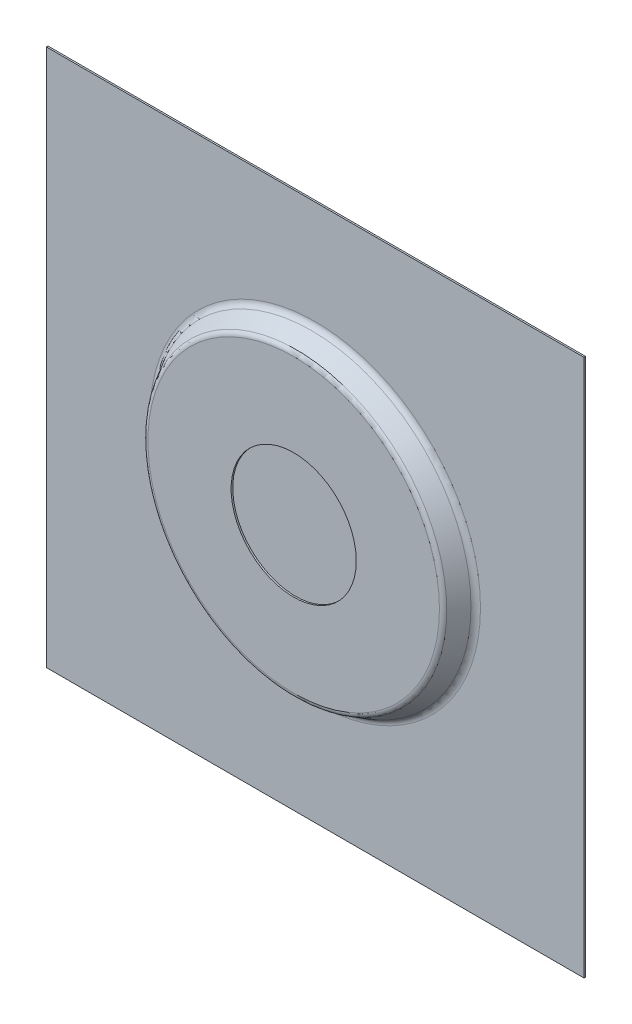
ISO-10303-21;
HEADER;
FILE_DESCRIPTION(('STEP AP214'),'2;1');
FILE_NAME('part.step','',(''),(''),'','','');
FILE_SCHEMA(('AUTOMOTIVE_DESIGN { 1 0 10303 214 1 1 1 1 }'));
ENDSEC;
DATA;
#1=APPLICATION_CONTEXT('core data for automotive mechanical design processes');
#2=APPLICATION_PROTOCOL_DEFINITION('international standard','automotive_design',2000,#1);
#3=PRODUCT_CONTEXT('',#1,'mechanical');
#4=PRODUCT('Part','Part','',(#3));
#5=PRODUCT_RELATED_PRODUCT_CATEGORY('part','',(#4));
#6=PRODUCT_DEFINITION_FORMATION('','',#4);
#7=PRODUCT_DEFINITION_CONTEXT('part definition',#1,'design');
#8=PRODUCT_DEFINITION('design','',#6,#7);
#9=PRODUCT_DEFINITION_SHAPE('','',#8);
#10=(LENGTH_UNIT() NAMED_UNIT(*) SI_UNIT(.MILLI.,.METRE.));
#11=(NAMED_UNIT(*) PLANE_ANGLE_UNIT() SI_UNIT($,.RADIAN.));
#12=(NAMED_UNIT(*) SI_UNIT($,.STERADIAN.) SOLID_ANGLE_UNIT());
#13=UNCERTAINTY_MEASURE_WITH_UNIT(LENGTH_MEASURE(1.E-05),#10,'distance_accuracy_value','');
#14=(GEOMETRIC_REPRESENTATION_CONTEXT(3) GLOBAL_UNCERTAINTY_ASSIGNED_CONTEXT((#13)) GLOBAL_UNIT_ASSIGNED_CONTEXT((#10,
#11,#12)) REPRESENTATION_CONTEXT('',''));
#15=CARTESIAN_POINT('',(0.,0.,0.));
#16=DIRECTION('',(0.,0.,1.));
#17=DIRECTION('',(1.,0.,0.));
#18=AXIS2_PLACEMENT_3D('',#15,#16,#17);
#19=CARTESIAN_POINT('',(0.,0.,6.5));
#20=DIRECTION('',(0.,0.,-1.));
#21=DIRECTION('',(-1.,0.,0.));
#22=AXIS2_PLACEMENT_3D('',#19,#20,#21);
#23=TOROIDAL_SURFACE('',#22,153.752776749733,8.);
#24=CARTESIAN_POINT('',(0.,0.,-1.5));
#25=DIRECTION('',(0.,0.,-1.));
#26=DIRECTION('',(-1.,0.,0.));
#27=AXIS2_PLACEMENT_3D('',#24,#25,#26);
#28=CIRCLE('',#27,153.752776749733);
#29=CARTESIAN_POINT('',(-153.752776749733,0.,-1.5));
#30=VERTEX_POINT('',#29);
#31=EDGE_CURVE('E11',#30,#30,#28,.T.);
#32=ORIENTED_EDGE('',*,*,#31,.F.);
#33=EDGE_LOOP('',(#32));
#34=FACE_BOUND('',#33,.T.);
#35=CARTESIAN_POINT('',(0.,0.,2.5));
#36=DIRECTION('',(0.,0.,-1.));
#37=DIRECTION('',(-1.,0.,0.));
#38=AXIS2_PLACEMENT_3D('',#35,#36,#37);
#39=CIRCLE('',#38,146.824573519457);
#40=CARTESIAN_POINT('',(-146.824573519457,0.,2.5));
#41=VERTEX_POINT('',#40);
#42=EDGE_CURVE('E58',#41,#41,#39,.F.);
#43=ORIENTED_EDGE('',*,*,#42,.F.);
#44=EDGE_LOOP('',(#43));
#45=FACE_BOUND('',#44,.T.);
#46=ADVANCED_FACE('F52',(#34,#45),#23,.F.);
#47=CARTESIAN_POINT('',(0.,0.,-0.750000000000002));
#48=DIRECTION('',(0.,0.,-1.));
#49=DIRECTION('',(1.,0.,0.));
#50=AXIS2_PLACEMENT_3D('',#47,#48,#49);
#51=CONICAL_SURFACE('',#50,148.700961894323,0.5235987755983);
#52=ORIENTED_EDGE('',*,*,#42,.T.);
#53=EDGE_LOOP('',(#52));
#54=FACE_BOUND('',#53,.T.);
#55=CARTESIAN_POINT('',(0.,0.,16.75));
#56=DIRECTION('',(0.,0.,-1.));
#57=DIRECTION('',(-1.,0.,0.));
#58=AXIS2_PLACEMENT_3D('',#55,#56,#57);
#59=CIRCLE('',#58,138.597332183505);
#60=CARTESIAN_POINT('',(-138.597332183505,0.,16.75));
#61=VERTEX_POINT('',#60);
#62=EDGE_CURVE('E63',#61,#61,#59,.T.);
#63=ORIENTED_EDGE('',*,*,#62,.T.);
#64=EDGE_LOOP('',(#63));
#65=FACE_BOUND('',#64,.T.);
#66=ADVANCED_FACE('F76',(#54,#65),#51,.T.);
#67=CARTESIAN_POINT('',(0.,0.,15.));
#68=DIRECTION('',(0.,0.,1.));
#69=DIRECTION('',(1.,0.,0.));
#70=AXIS2_PLACEMENT_3D('',#67,#68,#69);
#71=TOROIDAL_SURFACE('',#70,135.566243270259,3.5);
#72=ORIENTED_EDGE('',*,*,#62,.F.);
#73=EDGE_LOOP('',(#72));
#74=FACE_BOUND('',#73,.T.);
#75=CARTESIAN_POINT('',(0.,0.,18.5));
#76=DIRECTION('',(0.,0.,1.));
#77=DIRECTION('',(1.,0.,0.));
#78=AXIS2_PLACEMENT_3D('',#75,#76,#77);
#79=CIRCLE('',#78,135.566243270259);
#80=CARTESIAN_POINT('',(135.566243270259,0.,18.5));
#81=VERTEX_POINT('',#80);
#82=EDGE_CURVE('E68',#81,#81,#79,.T.);
#83=ORIENTED_EDGE('',*,*,#82,.F.);
#84=EDGE_LOOP('',(#83));
#85=FACE_BOUND('',#84,.T.);
#86=ADVANCED_FACE('F74',(#74,#85),#71,.T.);
#87=CARTESIAN_POINT('',(0.,0.,18.5));
#88=DIRECTION('',(0.,0.,1.));
#89=DIRECTION('',(1.,0.,0.));
#90=AXIS2_PLACEMENT_3D('',#87,#88,#89);
#91=PLANE('',#90);
#92=ORIENTED_EDGE('',*,*,#82,.T.);
#93=EDGE_LOOP('',(#92));
#94=FACE_BOUND('',#93,.T.);
#95=ADVANCED_FACE('F53',(#94),#91,.T.);
#96=OPEN_SHELL('',(#46,#66,#86,#95));
#97=SHELL_BASED_SURFACE_MODEL('B2',(#96));
#98=CARTESIAN_POINT('',(250.,-250.,-1.5));
#99=DIRECTION('',(1.,0.,0.));
#100=DIRECTION('',(0.,0.,-1.));
#101=AXIS2_PLACEMENT_3D('',#98,#99,#100);
#102=PLANE('',#101);
#103=DIRECTION('',(0.,1.,0.));
#104=VECTOR('',#103,1.);
#105=CARTESIAN_POINT('',(250.,-250.,0.));
#106=LINE('',#105,#104);
#107=CARTESIAN_POINT('',(250.,-250.,0.));
#108=VERTEX_POINT('',#107);
#109=CARTESIAN_POINT('',(250.,250.,0.));
#110=VERTEX_POINT('',#109);
#111=EDGE_CURVE('E191',#108,#110,#106,.T.);
#112=ORIENTED_EDGE('',*,*,#111,.F.);
#113=DIRECTION('',(0.,0.,1.));
#114=VECTOR('',#113,1.);
#115=CARTESIAN_POINT('',(250.,-250.,-1.5));
#116=LINE('',#115,#114);
#117=CARTESIAN_POINT('',(250.,-250.,-1.5));
#118=VERTEX_POINT('',#117);
#119=EDGE_CURVE('E134',#118,#108,#116,.T.);
#120=ORIENTED_EDGE('',*,*,#119,.F.);
#121=DIRECTION('',(0.,1.,0.));
#122=VECTOR('',#121,1.);
#123=CARTESIAN_POINT('',(250.,-250.,-1.5));
#124=LINE('',#123,#122);
#125=CARTESIAN_POINT('',(250.,250.,-1.5));
#126=VERTEX_POINT('',#125);
#127=EDGE_CURVE('E182',#118,#126,#124,.T.);
#128=ORIENTED_EDGE('',*,*,#127,.T.);
#129=DIRECTION('',(0.,0.,1.));
#130=VECTOR('',#129,1.);
#131=CARTESIAN_POINT('',(250.,250.,-1.5));
#132=LINE('',#131,#130);
#133=EDGE_CURVE('E162',#126,#110,#132,.T.);
#134=ORIENTED_EDGE('',*,*,#133,.T.);
#135=EDGE_LOOP('',(#112,#120,#128,#134));
#136=FACE_BOUND('',#135,.T.);
#137=ADVANCED_FACE('F115',(#136),#102,.T.);
#138=CARTESIAN_POINT('',(-250.,-250.,-1.5));
#139=DIRECTION('',(0.,-1.,0.));
#140=DIRECTION('',(0.,0.,-1.));
#141=AXIS2_PLACEMENT_3D('',#138,#139,#140);
#142=PLANE('',#141);
#143=DIRECTION('',(1.,0.,0.));
#144=VECTOR('',#143,1.);
#145=CARTESIAN_POINT('',(-250.,-250.,0.));
#146=LINE('',#145,#144);
#147=CARTESIAN_POINT('',(-250.,-250.,0.));
#148=VERTEX_POINT('',#147);
#149=EDGE_CURVE('E185',#148,#108,#146,.T.);
#150=ORIENTED_EDGE('',*,*,#149,.F.);
#151=DIRECTION('',(0.,0.,1.));
#152=VECTOR('',#151,1.);
#153=CARTESIAN_POINT('',(-250.,-250.,-1.5));
#154=LINE('',#153,#152);
#155=CARTESIAN_POINT('',(-250.,-250.,-1.5));
#156=VERTEX_POINT('',#155);
#157=EDGE_CURVE('E151',#156,#148,#154,.T.);
#158=ORIENTED_EDGE('',*,*,#157,.F.);
#159=DIRECTION('',(1.,0.,0.));
#160=VECTOR('',#159,1.);
#161=CARTESIAN_POINT('',(-250.,-250.,-1.5));
#162=LINE('',#161,#160);
#163=EDGE_CURVE('E177',#156,#118,#162,.T.);
#164=ORIENTED_EDGE('',*,*,#163,.T.);
#165=ORIENTED_EDGE('',*,*,#119,.T.);
#166=EDGE_LOOP('',(#150,#158,#164,#165));
#167=FACE_BOUND('',#166,.T.);
#168=ADVANCED_FACE('F242',(#167),#142,.T.);
#169=CARTESIAN_POINT('',(-250.,-250.,-1.5));
#170=DIRECTION('',(-1.,0.,0.));
#171=DIRECTION('',(0.,0.,1.));
#172=AXIS2_PLACEMENT_3D('',#169,#170,#171);
#173=PLANE('',#172);
#174=DIRECTION('',(0.,-1.,0.));
#175=VECTOR('',#174,1.);
#176=CARTESIAN_POINT('',(-250.,-250.,0.));
#177=LINE('',#176,#175);
#178=CARTESIAN_POINT('',(-250.,250.,0.));
#179=VERTEX_POINT('',#178);
#180=EDGE_CURVE('E170',#179,#148,#177,.T.);
#181=ORIENTED_EDGE('',*,*,#180,.F.);
#182=DIRECTION('',(0.,0.,1.));
#183=VECTOR('',#182,1.);
#184=CARTESIAN_POINT('',(-250.,250.,-1.5));
#185=LINE('',#184,#183);
#186=CARTESIAN_POINT('',(-250.,250.,-1.5));
#187=VERTEX_POINT('',#186);
#188=EDGE_CURVE('E165',#187,#179,#185,.T.);
#189=ORIENTED_EDGE('',*,*,#188,.F.);
#190=DIRECTION('',(0.,-1.,0.));
#191=VECTOR('',#190,1.);
#192=CARTESIAN_POINT('',(-250.,-250.,-1.5));
#193=LINE('',#192,#191);
#194=EDGE_CURVE('E168',#187,#156,#193,.T.);
#195=ORIENTED_EDGE('',*,*,#194,.T.);
#196=ORIENTED_EDGE('',*,*,#157,.T.);
#197=EDGE_LOOP('',(#181,#189,#195,#196));
#198=FACE_BOUND('',#197,.T.);
#199=ADVANCED_FACE('F167',(#198),#173,.T.);
#200=CARTESIAN_POINT('',(-250.,250.,-1.5));
#201=DIRECTION('',(0.,1.,0.));
#202=DIRECTION('',(0.,0.,1.));
#203=AXIS2_PLACEMENT_3D('',#200,#201,#202);
#204=PLANE('',#203);
#205=DIRECTION('',(-1.,0.,0.));
#206=VECTOR('',#205,1.);
#207=CARTESIAN_POINT('',(-250.,250.,0.));
#208=LINE('',#207,#206);
#209=EDGE_CURVE('E195',#110,#179,#208,.T.);
#210=ORIENTED_EDGE('',*,*,#209,.F.);
#211=ORIENTED_EDGE('',*,*,#133,.F.);
#212=DIRECTION('',(-1.,0.,0.));
#213=VECTOR('',#212,1.);
#214=CARTESIAN_POINT('',(-250.,250.,-1.5));
#215=LINE('',#214,#213);
#216=EDGE_CURVE('E176',#126,#187,#215,.T.);
#217=ORIENTED_EDGE('',*,*,#216,.T.);
#218=ORIENTED_EDGE('',*,*,#188,.T.);
#219=EDGE_LOOP('',(#210,#211,#217,#218));
#220=FACE_BOUND('',#219,.T.);
#221=ADVANCED_FACE('F180',(#220),#204,.T.);
#222=CARTESIAN_POINT('',(0.,0.,-1.5));
#223=DIRECTION('',(0.,0.,-1.));
#224=DIRECTION('',(-1.,0.,0.));
#225=AXIS2_PLACEMENT_3D('',#222,#223,#224);
#226=PLANE('',#225);
#227=CARTESIAN_POINT('',(0.,0.,-1.5));
#228=DIRECTION('',(0.,0.,-1.));
#229=DIRECTION('',(-1.,0.,0.));
#230=AXIS2_PLACEMENT_3D('',#227,#228,#229);
#231=CIRCLE('',#230,153.752776749733);
#232=CARTESIAN_POINT('',(-153.752776749733,0.,-1.5));
#233=VERTEX_POINT('',#232);
#234=EDGE_CURVE('E50',#233,#233,#231,.T.);
#235=ORIENTED_EDGE('',*,*,#234,.F.);
#236=EDGE_LOOP('',(#235));
#237=FACE_BOUND('',#236,.T.);
#238=ORIENTED_EDGE('',*,*,#127,.F.);
#239=ORIENTED_EDGE('',*,*,#163,.F.);
#240=ORIENTED_EDGE('',*,*,#194,.F.);
#241=ORIENTED_EDGE('',*,*,#216,.F.);
#242=EDGE_LOOP('',(#238,#239,#240,#241));
#243=FACE_BOUND('',#242,.T.);
#244=ADVANCED_FACE('F175',(#237,#243),#226,.T.);
#245=CARTESIAN_POINT('',(0.,0.,0.));
#246=DIRECTION('',(0.,0.,-1.));
#247=DIRECTION('',(-1.,0.,0.));
#248=AXIS2_PLACEMENT_3D('',#245,#246,#247);
#249=PLANE('',#248);
#250=CARTESIAN_POINT('',(0.,0.,0.));
#251=DIRECTION('',(0.,0.,-1.));
#252=DIRECTION('',(-1.,0.,0.));
#253=AXIS2_PLACEMENT_3D('',#250,#251,#252);
#254=CIRCLE('',#253,153.752776749733);
#255=CARTESIAN_POINT('',(-153.752776749733,0.,0.));
#256=VERTEX_POINT('',#255);
#257=EDGE_CURVE('E218',#256,#256,#254,.T.);
#258=ORIENTED_EDGE('',*,*,#257,.T.);
#259=EDGE_LOOP('',(#258));
#260=FACE_BOUND('',#259,.T.);
#261=ORIENTED_EDGE('',*,*,#111,.T.);
#262=ORIENTED_EDGE('',*,*,#209,.T.);
#263=ORIENTED_EDGE('',*,*,#180,.T.);
#264=ORIENTED_EDGE('',*,*,#149,.T.);
#265=EDGE_LOOP('',(#261,#262,#263,#264));
#266=FACE_BOUND('',#265,.T.);
#267=ADVANCED_FACE('F253',(#260,#266),#249,.F.);
#268=CARTESIAN_POINT('',(0.,0.,0.));
#269=DIRECTION('',(0.,0.,-1.));
#270=DIRECTION('',(1.,0.,0.));
#271=AXIS2_PLACEMENT_3D('',#268,#269,#270);
#272=CONICAL_SURFACE('',#271,150.,0.5235987755983);
#273=CARTESIAN_POINT('',(0.,0.,3.25));
#274=DIRECTION('',(0.,0.,-1.));
#275=DIRECTION('',(-1.,0.,0.));
#276=AXIS2_PLACEMENT_3D('',#273,#274,#275);
#277=CIRCLE('',#276,148.123611625134);
#278=CARTESIAN_POINT('',(-148.123611625134,0.,3.25));
#279=VERTEX_POINT('',#278);
#280=EDGE_CURVE('E214',#279,#279,#277,.F.);
#281=ORIENTED_EDGE('',*,*,#280,.T.);
#282=EDGE_LOOP('',(#281));
#283=FACE_BOUND('',#282,.T.);
#284=CARTESIAN_POINT('',(0.,0.,17.5));
#285=DIRECTION('',(0.,0.,-1.));
#286=DIRECTION('',(-1.,0.,0.));
#287=AXIS2_PLACEMENT_3D('',#284,#285,#286);
#288=CIRCLE('',#287,139.896370289182);
#289=CARTESIAN_POINT('',(-139.896370289182,0.,17.5));
#290=VERTEX_POINT('',#289);
#291=EDGE_CURVE('E206',#290,#290,#288,.T.);
#292=ORIENTED_EDGE('',*,*,#291,.T.);
#293=EDGE_LOOP('',(#292));
#294=FACE_BOUND('',#293,.T.);
#295=ADVANCED_FACE('F256',(#283,#294),#272,.T.);
#296=CARTESIAN_POINT('',(0.,0.,20.));
#297=DIRECTION('',(0.,0.,1.));
#298=DIRECTION('',(1.,0.,0.));
#299=AXIS2_PLACEMENT_3D('',#296,#297,#298);
#300=PLANE('',#299);
#301=CARTESIAN_POINT('',(0.,0.,20.));
#302=DIRECTION('',(0.,0.,1.));
#303=DIRECTION('',(1.,0.,0.));
#304=AXIS2_PLACEMENT_3D('',#301,#302,#303);
#305=CIRCLE('',#304,58.1962250746136);
#306=CARTESIAN_POINT('',(58.1962250746136,0.,20.));
#307=VERTEX_POINT('',#306);
#308=EDGE_CURVE('E286',#307,#307,#305,.T.);
#309=ORIENTED_EDGE('',*,*,#308,.F.);
#310=EDGE_LOOP('',(#309));
#311=FACE_BOUND('',#310,.T.);
#312=CARTESIAN_POINT('',(0.,0.,20.));
#313=DIRECTION('',(0.,0.,1.));
#314=DIRECTION('',(1.,0.,0.));
#315=AXIS2_PLACEMENT_3D('',#312,#313,#314);
#316=CIRCLE('',#315,135.566243270259);
#317=CARTESIAN_POINT('',(135.566243270259,0.,20.));
#318=VERTEX_POINT('',#317);
#319=EDGE_CURVE('E126',#318,#318,#316,.T.);
#320=ORIENTED_EDGE('',*,*,#319,.T.);
#321=EDGE_LOOP('',(#320));
#322=FACE_BOUND('',#321,.T.);
#323=ADVANCED_FACE('F226',(#311,#322),#300,.T.);
#324=CARTESIAN_POINT('',(0.,0.,6.5));
#325=DIRECTION('',(0.,0.,-1.));
#326=DIRECTION('',(-1.,0.,0.));
#327=AXIS2_PLACEMENT_3D('',#324,#325,#326);
#328=TOROIDAL_SURFACE('',#327,153.752776749733,6.5);
#329=ORIENTED_EDGE('',*,*,#257,.F.);
#330=EDGE_LOOP('',(#329));
#331=FACE_BOUND('',#330,.T.);
#332=ORIENTED_EDGE('',*,*,#280,.F.);
#333=EDGE_LOOP('',(#332));
#334=FACE_BOUND('',#333,.T.);
#335=ADVANCED_FACE('F230',(#331,#334),#328,.F.);
#336=CARTESIAN_POINT('',(0.,0.,15.));
#337=DIRECTION('',(0.,0.,1.));
#338=DIRECTION('',(1.,0.,0.));
#339=AXIS2_PLACEMENT_3D('',#336,#337,#338);
#340=TOROIDAL_SURFACE('',#339,135.566243270259,5.);
#341=ORIENTED_EDGE('',*,*,#291,.F.);
#342=EDGE_LOOP('',(#341));
#343=FACE_BOUND('',#342,.T.);
#344=ORIENTED_EDGE('',*,*,#319,.F.);
#345=EDGE_LOOP('',(#344));
#346=FACE_BOUND('',#345,.T.);
#347=ADVANCED_FACE('F117',(#343,#346),#340,.T.);
#348=CARTESIAN_POINT('',(0.,0.,6.5));
#349=DIRECTION('',(0.,0.,-1.));
#350=DIRECTION('',(-1.,0.,0.));
#351=AXIS2_PLACEMENT_3D('',#348,#349,#350);
#352=TOROIDAL_SURFACE('',#351,153.752776749733,8.);
#353=ORIENTED_EDGE('',*,*,#234,.T.);
#354=EDGE_LOOP('',(#353));
#355=FACE_BOUND('',#354,.T.);
#356=CARTESIAN_POINT('',(0.,0.,2.5));
#357=DIRECTION('',(0.,0.,-1.));
#358=DIRECTION('',(-1.,0.,0.));
#359=AXIS2_PLACEMENT_3D('',#356,#357,#358);
#360=CIRCLE('',#359,146.824573519457);
#361=CARTESIAN_POINT('',(-146.824573519457,0.,2.5));
#362=VERTEX_POINT('',#361);
#363=EDGE_CURVE('E196',#362,#362,#360,.F.);
#364=ORIENTED_EDGE('',*,*,#363,.T.);
#365=EDGE_LOOP('',(#364));
#366=FACE_BOUND('',#365,.T.);
#367=ADVANCED_FACE('F229',(#355,#366),#352,.T.);
#368=CARTESIAN_POINT('',(0.,0.,-0.750000000000002));
#369=DIRECTION('',(0.,0.,-1.));
#370=DIRECTION('',(1.,0.,0.));
#371=AXIS2_PLACEMENT_3D('',#368,#369,#370);
#372=CONICAL_SURFACE('',#371,148.700961894323,0.5235987755983);
#373=ORIENTED_EDGE('',*,*,#363,.F.);
#374=EDGE_LOOP('',(#373));
#375=FACE_BOUND('',#374,.T.);
#376=CARTESIAN_POINT('',(0.,0.,16.75));
#377=DIRECTION('',(0.,0.,-1.));
#378=DIRECTION('',(-1.,0.,0.));
#379=AXIS2_PLACEMENT_3D('',#376,#377,#378);
#380=CIRCLE('',#379,138.597332183505);
#381=CARTESIAN_POINT('',(-138.597332183505,0.,16.75));
#382=VERTEX_POINT('',#381);
#383=EDGE_CURVE('E294',#382,#382,#380,.T.);
#384=ORIENTED_EDGE('',*,*,#383,.F.);
#385=EDGE_LOOP('',(#384));
#386=FACE_BOUND('',#385,.T.);
#387=ADVANCED_FACE('F236',(#375,#386),#372,.F.);
#388=CARTESIAN_POINT('',(0.,0.,15.));
#389=DIRECTION('',(0.,0.,1.));
#390=DIRECTION('',(1.,0.,0.));
#391=AXIS2_PLACEMENT_3D('',#388,#389,#390);
#392=TOROIDAL_SURFACE('',#391,135.566243270259,3.5);
#393=ORIENTED_EDGE('',*,*,#383,.T.);
#394=EDGE_LOOP('',(#393));
#395=FACE_BOUND('',#394,.T.);
#396=CARTESIAN_POINT('',(0.,0.,18.5));
#397=DIRECTION('',(0.,0.,1.));
#398=DIRECTION('',(1.,0.,0.));
#399=AXIS2_PLACEMENT_3D('',#396,#397,#398);
#400=CIRCLE('',#399,135.566243270259);
#401=CARTESIAN_POINT('',(135.566243270259,0.,18.5));
#402=VERTEX_POINT('',#401);
#403=EDGE_CURVE('E290',#402,#402,#400,.T.);
#404=ORIENTED_EDGE('',*,*,#403,.T.);
#405=EDGE_LOOP('',(#404));
#406=FACE_BOUND('',#405,.T.);
#407=ADVANCED_FACE('F271',(#395,#406),#392,.F.);
#408=CARTESIAN_POINT('',(0.,0.,18.5));
#409=DIRECTION('',(0.,0.,1.));
#410=DIRECTION('',(1.,0.,0.));
#411=AXIS2_PLACEMENT_3D('',#408,#409,#410);
#412=PLANE('',#411);
#413=CARTESIAN_POINT('',(0.,0.,18.5));
#414=DIRECTION('',(0.,0.,1.));
#415=DIRECTION('',(1.,0.,0.));
#416=AXIS2_PLACEMENT_3D('',#413,#414,#415);
#417=CIRCLE('',#416,58.1962250746136);
#418=CARTESIAN_POINT('',(58.1962250746136,0.,18.5));
#419=VERTEX_POINT('',#418);
#420=EDGE_CURVE('E119',#419,#419,#417,.T.);
#421=ORIENTED_EDGE('',*,*,#420,.T.);
#422=EDGE_LOOP('',(#421));
#423=FACE_BOUND('',#422,.T.);
#424=ORIENTED_EDGE('',*,*,#403,.F.);
#425=EDGE_LOOP('',(#424));
#426=FACE_BOUND('',#425,.T.);
#427=ADVANCED_FACE('F267',(#423,#426),#412,.F.);
#428=CARTESIAN_POINT('',(0.,0.,8.5));
#429=DIRECTION('',(0.,0.,1.));
#430=DIRECTION('',(1.,0.,0.));
#431=AXIS2_PLACEMENT_3D('',#428,#429,#430);
#432=CYLINDRICAL_SURFACE('',#431,58.1962250746136);
#433=ORIENTED_EDGE('',*,*,#308,.T.);
#434=EDGE_LOOP('',(#433));
#435=FACE_BOUND('',#434,.T.);
#436=ORIENTED_EDGE('',*,*,#420,.F.);
#437=EDGE_LOOP('',(#436));
#438=FACE_BOUND('',#437,.T.);
#439=ADVANCED_FACE('F270',(#435,#438),#432,.F.);
#440=CLOSED_SHELL('',(#137,#168,#199,#221,#244,#267,#295,#323,#335,#347,#367,#387,#407,#427,#439));
#441=MANIFOLD_SOLID_BREP('B6',#440);
#442=ADVANCED_BREP_SHAPE_REPRESENTATION('',(#18,#441),#14);
#443=MANIFOLD_SURFACE_SHAPE_REPRESENTATION('',(#18,#97),#14);
#444=SHAPE_REPRESENTATION('',(#18),#14);
#445=SHAPE_DEFINITION_REPRESENTATION(#9,#444);
#446=SHAPE_REPRESENTATION_RELATIONSHIP('','',#444,#442);
#447=SHAPE_REPRESENTATION_RELATIONSHIP('','',#444,#443);
ENDSEC;
END-ISO-10303-21;
